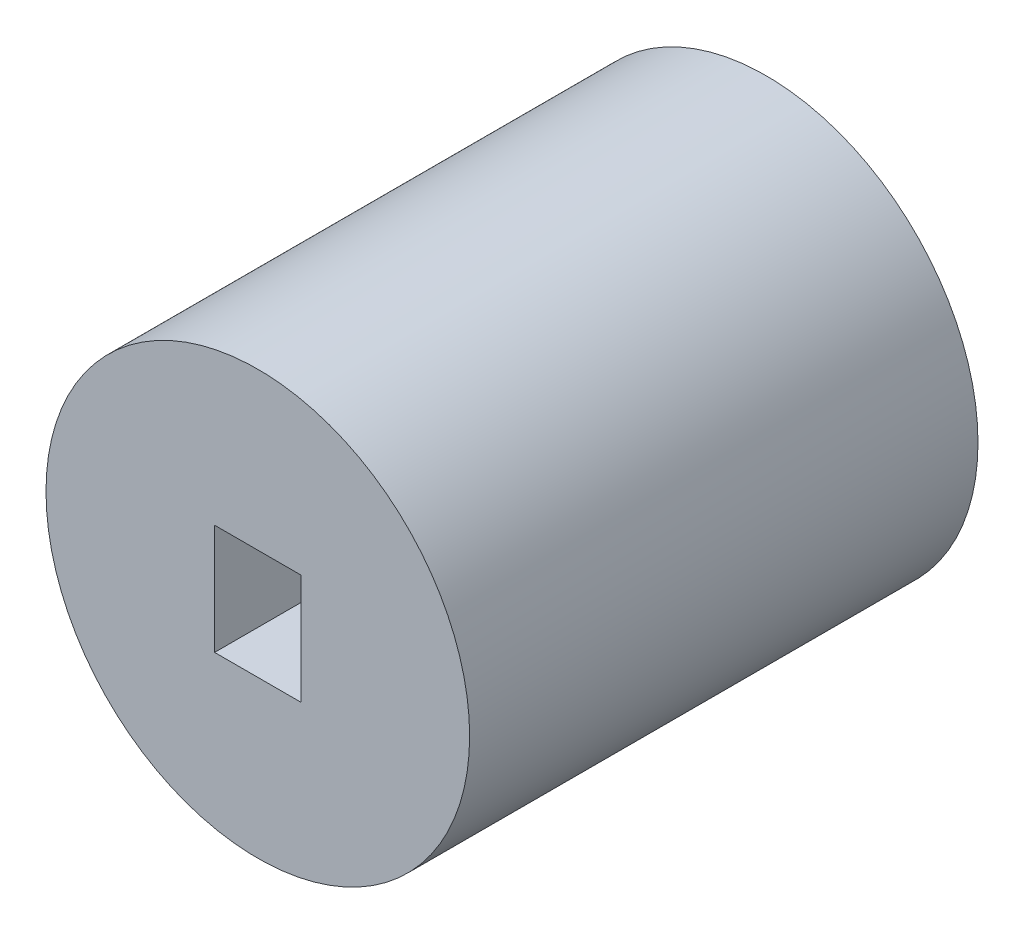
ISO-10303-21;
HEADER;
FILE_DESCRIPTION(('STEP AP214'),'2;1');
FILE_NAME('part.step','',(''),(''),'','','');
FILE_SCHEMA(('AUTOMOTIVE_DESIGN { 1 0 10303 214 1 1 1 1 }'));
ENDSEC;
DATA;
#1=APPLICATION_CONTEXT('core data for automotive mechanical design processes');
#2=APPLICATION_PROTOCOL_DEFINITION('international standard','automotive_design',2000,#1);
#3=PRODUCT_CONTEXT('',#1,'mechanical');
#4=PRODUCT('Part','Part','',(#3));
#5=PRODUCT_RELATED_PRODUCT_CATEGORY('part','',(#4));
#6=PRODUCT_DEFINITION_FORMATION('','',#4);
#7=PRODUCT_DEFINITION_CONTEXT('part definition',#1,'design');
#8=PRODUCT_DEFINITION('design','',#6,#7);
#9=PRODUCT_DEFINITION_SHAPE('','',#8);
#10=(LENGTH_UNIT() NAMED_UNIT(*) SI_UNIT(.MILLI.,.METRE.));
#11=(NAMED_UNIT(*) PLANE_ANGLE_UNIT() SI_UNIT($,.RADIAN.));
#12=(NAMED_UNIT(*) SI_UNIT($,.STERADIAN.) SOLID_ANGLE_UNIT());
#13=UNCERTAINTY_MEASURE_WITH_UNIT(LENGTH_MEASURE(1.E-05),#10,'distance_accuracy_value','');
#14=(GEOMETRIC_REPRESENTATION_CONTEXT(3) GLOBAL_UNCERTAINTY_ASSIGNED_CONTEXT((#13)) GLOBAL_UNIT_ASSIGNED_CONTEXT((#10,
#11,#12)) REPRESENTATION_CONTEXT('',''));
#15=CARTESIAN_POINT('',(0.,0.,0.));
#16=DIRECTION('',(0.,0.,1.));
#17=DIRECTION('',(1.,0.,0.));
#18=AXIS2_PLACEMENT_3D('',#15,#16,#17);
#19=CARTESIAN_POINT('',(0.,-0.325,-4.636809247748));
#20=DIRECTION('',(0.,-1.,0.));
#21=DIRECTION('',(0.,0.,-1.));
#22=AXIS2_PLACEMENT_3D('',#19,#20,#21);
#23=PLANE('',#22);
#24=DIRECTION('',(0.,0.,-1.));
#25=VECTOR('',#24,1.);
#26=CARTESIAN_POINT('',(0.255,-0.325,-4.636809247748));
#27=LINE('',#26,#25);
#28=CARTESIAN_POINT('',(0.255,-0.325,3.));
#29=VERTEX_POINT('',#28);
#30=CARTESIAN_POINT('',(0.255,-0.325,0.));
#31=VERTEX_POINT('',#30);
#32=EDGE_CURVE('E65',#29,#31,#27,.T.);
#33=ORIENTED_EDGE('',*,*,#32,.T.);
#34=DIRECTION('',(1.,0.,0.));
#35=VECTOR('',#34,1.);
#36=CARTESIAN_POINT('',(0.,-0.325,0.));
#37=LINE('',#36,#35);
#38=CARTESIAN_POINT('',(-0.255,-0.325,0.));
#39=VERTEX_POINT('',#38);
#40=EDGE_CURVE('E57',#39,#31,#37,.T.);
#41=ORIENTED_EDGE('',*,*,#40,.F.);
#42=DIRECTION('',(0.,0.,1.));
#43=VECTOR('',#42,1.);
#44=CARTESIAN_POINT('',(-0.255,-0.325,-4.636809247748));
#45=LINE('',#44,#43);
#46=CARTESIAN_POINT('',(-0.255,-0.325,3.));
#47=VERTEX_POINT('',#46);
#48=EDGE_CURVE('E83',#39,#47,#45,.T.);
#49=ORIENTED_EDGE('',*,*,#48,.T.);
#50=DIRECTION('',(1.,0.,0.));
#51=VECTOR('',#50,1.);
#52=CARTESIAN_POINT('',(0.,-0.325,3.));
#53=LINE('',#52,#51);
#54=EDGE_CURVE('E52',#29,#47,#53,.F.);
#55=ORIENTED_EDGE('',*,*,#54,.F.);
#56=EDGE_LOOP('',(#33,#41,#49,#55));
#57=FACE_BOUND('',#56,.T.);
#58=ADVANCED_FACE('F17',(#57),#23,.F.);
#59=CARTESIAN_POINT('',(0.255,0.,-4.636809247748));
#60=DIRECTION('',(1.,0.,0.));
#61=DIRECTION('',(0.,0.,-1.));
#62=AXIS2_PLACEMENT_3D('',#59,#60,#61);
#63=PLANE('',#62);
#64=DIRECTION('',(0.,0.,1.));
#65=VECTOR('',#64,1.);
#66=CARTESIAN_POINT('',(0.255,0.325,-4.636809247748));
#67=LINE('',#66,#65);
#68=CARTESIAN_POINT('',(0.255,0.325,3.));
#69=VERTEX_POINT('',#68);
#70=CARTESIAN_POINT('',(0.255,0.325,0.));
#71=VERTEX_POINT('',#70);
#72=EDGE_CURVE('E70',#69,#71,#67,.F.);
#73=ORIENTED_EDGE('',*,*,#72,.T.);
#74=DIRECTION('',(0.,1.,0.));
#75=VECTOR('',#74,1.);
#76=CARTESIAN_POINT('',(0.255,0.,0.));
#77=LINE('',#76,#75);
#78=EDGE_CURVE('E61',#31,#71,#77,.T.);
#79=ORIENTED_EDGE('',*,*,#78,.F.);
#80=ORIENTED_EDGE('',*,*,#32,.F.);
#81=DIRECTION('',(0.,1.,0.));
#82=VECTOR('',#81,1.);
#83=CARTESIAN_POINT('',(0.255,0.,3.));
#84=LINE('',#83,#82);
#85=EDGE_CURVE('E72',#69,#29,#84,.F.);
#86=ORIENTED_EDGE('',*,*,#85,.F.);
#87=EDGE_LOOP('',(#73,#79,#80,#86));
#88=FACE_BOUND('',#87,.T.);
#89=ADVANCED_FACE('F68',(#88),#63,.F.);
#90=CARTESIAN_POINT('',(-0.255,0.,-4.636809247748));
#91=DIRECTION('',(-1.,0.,0.));
#92=DIRECTION('',(0.,0.,1.));
#93=AXIS2_PLACEMENT_3D('',#90,#91,#92);
#94=PLANE('',#93);
#95=ORIENTED_EDGE('',*,*,#48,.F.);
#96=DIRECTION('',(0.,1.,0.));
#97=VECTOR('',#96,1.);
#98=CARTESIAN_POINT('',(-0.255,0.,0.));
#99=LINE('',#98,#97);
#100=CARTESIAN_POINT('',(-0.255,0.325,0.));
#101=VERTEX_POINT('',#100);
#102=EDGE_CURVE('E33',#101,#39,#99,.F.);
#103=ORIENTED_EDGE('',*,*,#102,.F.);
#104=DIRECTION('',(0.,0.,1.));
#105=VECTOR('',#104,1.);
#106=CARTESIAN_POINT('',(-0.255,0.325,-4.636809247748));
#107=LINE('',#106,#105);
#108=CARTESIAN_POINT('',(-0.255,0.325,3.));
#109=VERTEX_POINT('',#108);
#110=EDGE_CURVE('E86',#101,#109,#107,.T.);
#111=ORIENTED_EDGE('',*,*,#110,.T.);
#112=DIRECTION('',(0.,1.,0.));
#113=VECTOR('',#112,1.);
#114=CARTESIAN_POINT('',(-0.255,0.,3.));
#115=LINE('',#114,#113);
#116=EDGE_CURVE('E82',#47,#109,#115,.T.);
#117=ORIENTED_EDGE('',*,*,#116,.F.);
#118=EDGE_LOOP('',(#95,#103,#111,#117));
#119=FACE_BOUND('',#118,.T.);
#120=ADVANCED_FACE('F85',(#119),#94,.F.);
#121=CARTESIAN_POINT('',(0.,0.325,-4.636809247748));
#122=DIRECTION('',(0.,1.,0.));
#123=DIRECTION('',(0.,0.,1.));
#124=AXIS2_PLACEMENT_3D('',#121,#122,#123);
#125=PLANE('',#124);
#126=ORIENTED_EDGE('',*,*,#110,.F.);
#127=DIRECTION('',(1.,0.,0.));
#128=VECTOR('',#127,1.);
#129=CARTESIAN_POINT('',(0.,0.325,0.));
#130=LINE('',#129,#128);
#131=EDGE_CURVE('E88',#101,#71,#130,.T.);
#132=ORIENTED_EDGE('',*,*,#131,.T.);
#133=ORIENTED_EDGE('',*,*,#72,.F.);
#134=DIRECTION('',(1.,0.,0.));
#135=VECTOR('',#134,1.);
#136=CARTESIAN_POINT('',(0.,0.325,3.));
#137=LINE('',#136,#135);
#138=EDGE_CURVE('E89',#109,#69,#137,.T.);
#139=ORIENTED_EDGE('',*,*,#138,.F.);
#140=EDGE_LOOP('',(#126,#132,#133,#139));
#141=FACE_BOUND('',#140,.T.);
#142=ADVANCED_FACE('F96',(#141),#125,.F.);
#143=CARTESIAN_POINT('',(0.,0.,3.));
#144=DIRECTION('',(0.,0.,1.));
#145=DIRECTION('',(1.,0.,0.));
#146=AXIS2_PLACEMENT_3D('',#143,#144,#145);
#147=PLANE('',#146);
#148=CARTESIAN_POINT('',(0.,0.,3.));
#149=DIRECTION('',(0.,0.,1.));
#150=DIRECTION('',(1.,0.,0.));
#151=AXIS2_PLACEMENT_3D('',#148,#149,#150);
#152=CIRCLE('',#151,1.25);
#153=CARTESIAN_POINT('',(1.25,0.,3.));
#154=VERTEX_POINT('',#153);
#155=EDGE_CURVE('E20',#154,#154,#152,.F.);
#156=ORIENTED_EDGE('',*,*,#155,.F.);
#157=EDGE_LOOP('',(#156));
#158=FACE_BOUND('',#157,.T.);
#159=ORIENTED_EDGE('',*,*,#54,.T.);
#160=ORIENTED_EDGE('',*,*,#116,.T.);
#161=ORIENTED_EDGE('',*,*,#138,.T.);
#162=ORIENTED_EDGE('',*,*,#85,.T.);
#163=EDGE_LOOP('',(#159,#160,#161,#162));
#164=FACE_BOUND('',#163,.T.);
#165=ADVANCED_FACE('F79',(#158,#164),#147,.T.);
#166=CARTESIAN_POINT('',(0.,0.,0.));
#167=DIRECTION('',(0.,0.,1.));
#168=DIRECTION('',(1.,0.,0.));
#169=AXIS2_PLACEMENT_3D('',#166,#167,#168);
#170=PLANE('',#169);
#171=CARTESIAN_POINT('',(0.,0.,0.));
#172=DIRECTION('',(0.,0.,1.));
#173=DIRECTION('',(1.,0.,0.));
#174=AXIS2_PLACEMENT_3D('',#171,#172,#173);
#175=CIRCLE('',#174,1.25);
#176=CARTESIAN_POINT('',(1.25,0.,0.));
#177=VERTEX_POINT('',#176);
#178=EDGE_CURVE('E11',#177,#177,#175,.T.);
#179=ORIENTED_EDGE('',*,*,#178,.F.);
#180=EDGE_LOOP('',(#179));
#181=FACE_BOUND('',#180,.T.);
#182=ORIENTED_EDGE('',*,*,#102,.T.);
#183=ORIENTED_EDGE('',*,*,#40,.T.);
#184=ORIENTED_EDGE('',*,*,#78,.T.);
#185=ORIENTED_EDGE('',*,*,#131,.F.);
#186=EDGE_LOOP('',(#182,#183,#184,#185));
#187=FACE_BOUND('',#186,.T.);
#188=ADVANCED_FACE('F58',(#181,#187),#170,.F.);
#189=CARTESIAN_POINT('',(0.,0.,0.));
#190=DIRECTION('',(0.,0.,1.));
#191=DIRECTION('',(1.,0.,0.));
#192=AXIS2_PLACEMENT_3D('',#189,#190,#191);
#193=CYLINDRICAL_SURFACE('',#192,1.25);
#194=ORIENTED_EDGE('',*,*,#178,.T.);
#195=EDGE_LOOP('',(#194));
#196=FACE_BOUND('',#195,.T.);
#197=ORIENTED_EDGE('',*,*,#155,.T.);
#198=EDGE_LOOP('',(#197));
#199=FACE_BOUND('',#198,.T.);
#200=ADVANCED_FACE('F107',(#196,#199),#193,.T.);
#201=CLOSED_SHELL('',(#58,#89,#120,#142,#165,#188,#200));
#202=MANIFOLD_SOLID_BREP('B1',#201);
#203=ADVANCED_BREP_SHAPE_REPRESENTATION('',(#18,#202),#14);
#204=SHAPE_DEFINITION_REPRESENTATION(#9,#203);
ENDSEC;
END-ISO-10303-21;
